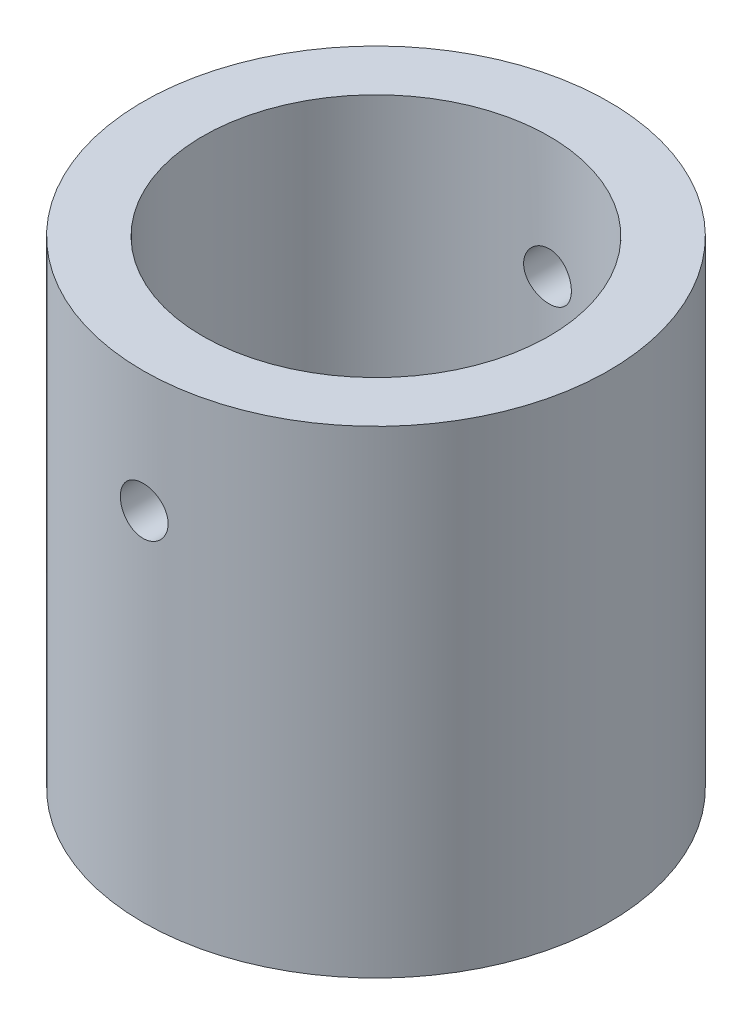
ISO-10303-21;
HEADER;
FILE_DESCRIPTION(('STEP AP214'),'2;1');
FILE_NAME('part.step','',(''),(''),'','','');
FILE_SCHEMA(('AUTOMOTIVE_DESIGN { 1 0 10303 214 1 1 1 1 }'));
ENDSEC;
DATA;
#1=APPLICATION_CONTEXT('core data for automotive mechanical design processes');
#2=APPLICATION_PROTOCOL_DEFINITION('international standard','automotive_design',2000,#1);
#3=PRODUCT_CONTEXT('',#1,'mechanical');
#4=PRODUCT('Part','Part','',(#3));
#5=PRODUCT_RELATED_PRODUCT_CATEGORY('part','',(#4));
#6=PRODUCT_DEFINITION_FORMATION('','',#4);
#7=PRODUCT_DEFINITION_CONTEXT('part definition',#1,'design');
#8=PRODUCT_DEFINITION('design','',#6,#7);
#9=PRODUCT_DEFINITION_SHAPE('','',#8);
#10=(LENGTH_UNIT() NAMED_UNIT(*) SI_UNIT(.MILLI.,.METRE.));
#11=(NAMED_UNIT(*) PLANE_ANGLE_UNIT() SI_UNIT($,.RADIAN.));
#12=(NAMED_UNIT(*) SI_UNIT($,.STERADIAN.) SOLID_ANGLE_UNIT());
#13=UNCERTAINTY_MEASURE_WITH_UNIT(LENGTH_MEASURE(1.E-05),#10,'distance_accuracy_value','');
#14=(GEOMETRIC_REPRESENTATION_CONTEXT(3) GLOBAL_UNCERTAINTY_ASSIGNED_CONTEXT((#13)) GLOBAL_UNIT_ASSIGNED_CONTEXT((#10,
#11,#12)) REPRESENTATION_CONTEXT('',''));
#15=CARTESIAN_POINT('',(0.,0.,0.));
#16=DIRECTION('',(0.,0.,1.));
#17=DIRECTION('',(1.,0.,0.));
#18=AXIS2_PLACEMENT_3D('',#15,#16,#17);
#19=CARTESIAN_POINT('',(0.,40.,0.));
#20=DIRECTION('',(0.,1.,0.));
#21=DIRECTION('',(0.,0.,1.));
#22=AXIS2_PLACEMENT_3D('',#19,#20,#21);
#23=PLANE('',#22);
#24=CARTESIAN_POINT('',(0.,40.,0.));
#25=DIRECTION('',(0.,1.,0.));
#26=DIRECTION('',(0.,0.,1.));
#27=AXIS2_PLACEMENT_3D('',#24,#25,#26);
#28=CIRCLE('',#27,19.5);
#29=CARTESIAN_POINT('',(0.,40.,19.5));
#30=VERTEX_POINT('',#29);
#31=EDGE_CURVE('E10',#30,#30,#28,.T.);
#32=ORIENTED_EDGE('',*,*,#31,.T.);
#33=EDGE_LOOP('',(#32));
#34=FACE_BOUND('',#33,.T.);
#35=CARTESIAN_POINT('',(0.,40.,0.));
#36=DIRECTION('',(0.,1.,0.));
#37=DIRECTION('',(0.,0.,1.));
#38=AXIS2_PLACEMENT_3D('',#35,#36,#37);
#39=CIRCLE('',#38,14.5);
#40=CARTESIAN_POINT('',(0.,40.,14.5));
#41=VERTEX_POINT('',#40);
#42=EDGE_CURVE('E49',#41,#41,#39,.T.);
#43=ORIENTED_EDGE('',*,*,#42,.F.);
#44=EDGE_LOOP('',(#43));
#45=FACE_BOUND('',#44,.T.);
#46=ADVANCED_FACE('F31',(#34,#45),#23,.T.);
#47=CARTESIAN_POINT('',(0.,0.,0.));
#48=DIRECTION('',(0.,1.,0.));
#49=DIRECTION('',(0.,0.,1.));
#50=AXIS2_PLACEMENT_3D('',#47,#48,#49);
#51=PLANE('',#50);
#52=CARTESIAN_POINT('',(0.,0.,0.));
#53=DIRECTION('',(0.,1.,0.));
#54=DIRECTION('',(0.,0.,1.));
#55=AXIS2_PLACEMENT_3D('',#52,#53,#54);
#56=CIRCLE('',#55,19.5);
#57=CARTESIAN_POINT('',(0.,0.,19.5));
#58=VERTEX_POINT('',#57);
#59=EDGE_CURVE('E44',#58,#58,#56,.T.);
#60=ORIENTED_EDGE('',*,*,#59,.F.);
#61=EDGE_LOOP('',(#60));
#62=FACE_BOUND('',#61,.T.);
#63=CARTESIAN_POINT('',(0.,0.,0.));
#64=DIRECTION('',(0.,1.,0.));
#65=DIRECTION('',(0.,0.,1.));
#66=AXIS2_PLACEMENT_3D('',#63,#64,#65);
#67=CIRCLE('',#66,14.5);
#68=CARTESIAN_POINT('',(0.,0.,14.5));
#69=VERTEX_POINT('',#68);
#70=EDGE_CURVE('E52',#69,#69,#67,.T.);
#71=ORIENTED_EDGE('',*,*,#70,.T.);
#72=EDGE_LOOP('',(#71));
#73=FACE_BOUND('',#72,.T.);
#74=ADVANCED_FACE('F85',(#62,#73),#51,.F.);
#75=CARTESIAN_POINT('',(0.,40.,0.));
#76=DIRECTION('',(0.,-1.,0.));
#77=DIRECTION('',(0.,0.,-1.));
#78=AXIS2_PLACEMENT_3D('',#75,#76,#77);
#79=CYLINDRICAL_SURFACE('',#78,19.5);
#80=CARTESIAN_POINT('',(0.,31.84,-19.5));
#81=CARTESIAN_POINT('',(-0.112025180184587,31.8399951565444,-19.4999986810511));
#82=CARTESIAN_POINT('',(-0.224124051119736,31.8305560757284,-19.4990243909818));
#83=CARTESIAN_POINT('',(-0.44521291074643,31.7930448263763,-19.4952314437903));
#84=CARTESIAN_POINT('',(-0.554199354046032,31.7649522284396,-19.4924107645438));
#85=CARTESIAN_POINT('',(-0.765829840515245,31.6909612949408,-19.4852433840448));
#86=CARTESIAN_POINT('',(-0.868477710756236,31.6450738277728,-19.4808976144101));
#87=CARTESIAN_POINT('',(-1.06459238823249,31.5368170888447,-19.4711657454073));
#88=CARTESIAN_POINT('',(-1.1580609928738,31.4744510526403,-19.4657798503229));
#89=CARTESIAN_POINT('',(-1.33353892458411,31.3347549149492,-19.454548129124));
#90=CARTESIAN_POINT('',(-1.41550871421624,31.2573752635115,-19.4487008191805));
#91=CARTESIAN_POINT('',(-1.56532230576065,31.0899541931553,-19.4372175375322));
#92=CARTESIAN_POINT('',(-1.63316544845783,30.9999121836806,-19.4315815756999));
#93=CARTESIAN_POINT('',(-1.75294069591951,30.8094739342035,-19.4211440076958));
#94=CARTESIAN_POINT('',(-1.80483689511347,30.7090549988947,-19.4163442947539));
#95=CARTESIAN_POINT('',(-1.89101584315679,30.5008706650061,-19.4081411822273));
#96=CARTESIAN_POINT('',(-1.92529904843721,30.3931054568829,-19.4047377464592));
#97=CARTESIAN_POINT('',(-1.97516132119122,30.1736916247417,-19.3997260285492));
#98=CARTESIAN_POINT('',(-1.99080608958079,30.0620580778236,-19.3981114420907));
#99=CARTESIAN_POINT('',(-2.00315050418271,29.8377389357326,-19.3968406876895));
#100=CARTESIAN_POINT('',(-1.99985067262354,29.7250533696452,-19.3971844657623));
#101=CARTESIAN_POINT('',(-1.97445368912684,29.5022822746382,-19.3997858396071));
#102=CARTESIAN_POINT('',(-1.95242833200684,29.392188463391,-19.4020361255961));
#103=CARTESIAN_POINT('',(-1.89031725581556,29.1772682698757,-19.4081855481584));
#104=CARTESIAN_POINT('',(-1.85023128137963,29.0724419621095,-19.4120847080455));
#105=CARTESIAN_POINT('',(-1.75305780976249,28.8708059626273,-19.421100941461));
#106=CARTESIAN_POINT('',(-1.69593852031016,28.774011698217,-19.4262202888213));
#107=CARTESIAN_POINT('',(-1.56634266101633,28.5913562588842,-19.4370981683549));
#108=CARTESIAN_POINT('',(-1.4938656182275,28.5054954207907,-19.4428567202101));
#109=CARTESIAN_POINT('',(-1.33521090456262,28.3467269547503,-19.4543967306967));
#110=CARTESIAN_POINT('',(-1.24897124093783,28.2738812595,-19.4601781716778));
#111=CARTESIAN_POINT('',(-1.06545440822544,28.1436911298861,-19.4710873345973));
#112=CARTESIAN_POINT('',(-0.968177225766599,28.0863467143017,-19.4762150557437));
#113=CARTESIAN_POINT('',(-0.765303339599141,27.9887891925955,-19.4852408349864));
#114=CARTESIAN_POINT('',(-0.65970508126519,27.9485792967481,-19.4891386626178));
#115=CARTESIAN_POINT('',(-0.443207123395545,27.8864779639034,-19.4952631497866));
#116=CARTESIAN_POINT('',(-0.332307590772803,27.8645859505605,-19.497489861903));
#117=CARTESIAN_POINT('',(-0.108891376667279,27.8398205431224,-19.5000144652782));
#118=CARTESIAN_POINT('',(0.003615739053416,27.8368617001957,-19.500321022412));
#119=CARTESIAN_POINT('',(0.227524253908415,27.849822095988,-19.4989940267487));
#120=CARTESIAN_POINT('',(0.33892566874793,27.8657410661811,-19.4973605015482));
#121=CARTESIAN_POINT('',(0.557213365608078,27.915934308039,-19.4923424321098));
#122=CARTESIAN_POINT('',(0.664108958318472,27.9501685026422,-19.4889617116019));
#123=CARTESIAN_POINT('',(0.870640224265548,28.0359791794391,-19.4808284462844));
#124=CARTESIAN_POINT('',(0.970275726685756,28.0875560695142,-19.4760758692107));
#125=CARTESIAN_POINT('',(1.15984443262927,28.2067994922284,-19.4657087369188));
#126=CARTESIAN_POINT('',(1.24974220690165,28.2745220857959,-19.4600912030288));
#127=CARTESIAN_POINT('',(1.41692478748063,28.4240542373167,-19.4486338743726));
#128=CARTESIAN_POINT('',(1.49420926035752,28.505864167548,-19.4427940737359));
#129=CARTESIAN_POINT('',(1.63426870733692,28.6816218842848,-19.4315242583797));
#130=CARTESIAN_POINT('',(1.69698754826951,28.7756145225913,-19.4260958815963));
#131=CARTESIAN_POINT('',(1.80574931296192,28.9728486589695,-19.416288629334));
#132=CARTESIAN_POINT('',(1.8517924749619,29.0760900248812,-19.4119097388618));
#133=CARTESIAN_POINT('',(1.92580219757973,29.2886995225691,-19.4047075591265));
#134=CARTESIAN_POINT('',(1.95380199488496,29.3980559837289,-19.4018814110666));
#135=CARTESIAN_POINT('',(1.99103794735862,29.6199486763091,-19.3980958808558));
#136=CARTESIAN_POINT('',(2.00027467117286,29.7324848112593,-19.3971364421313));
#137=CARTESIAN_POINT('',(1.99971415407476,29.9569843971802,-19.3971941927134));
#138=CARTESIAN_POINT('',(1.99000509057273,30.0689480810849,-19.3982022250288));
#139=CARTESIAN_POINT('',(1.95201365673844,30.2896447245419,-19.4020617974663));
#140=CARTESIAN_POINT('',(1.92373126697921,30.3983776807149,-19.4049133395166));
#141=CARTESIAN_POINT('',(1.84942065391082,30.6095246432533,-19.4121360664466));
#142=CARTESIAN_POINT('',(1.80339517615205,30.711939624414,-19.4165070162041));
#143=CARTESIAN_POINT('',(1.69491391423251,30.9076050407409,-19.4262765288457));
#144=CARTESIAN_POINT('',(1.63245819416312,31.0008555116541,-19.4316750877213));
#145=CARTESIAN_POINT('',(1.49255847083774,31.1759967259707,-19.4429216409658));
#146=CARTESIAN_POINT('',(1.41504873946363,31.2578348464039,-19.4487715358431));
#147=CARTESIAN_POINT('',(1.24737229417964,31.4073810988009,-19.4602443118059));
#148=CARTESIAN_POINT('',(1.1572025577871,31.4750858468992,-19.4658671382665));
#149=CARTESIAN_POINT('',(0.966504469217087,31.5945850184977,-19.4762677350467));
#150=CARTESIAN_POINT('',(0.865949470660139,31.6463370852421,-19.4810432415944));
#151=CARTESIAN_POINT('',(0.657591178452996,31.7321523276174,-19.4891867294249));
#152=CARTESIAN_POINT('',(0.549796184820649,31.7662353810575,-19.492556291572));
#153=CARTESIAN_POINT('',(0.36782966191562,31.8072776514574,-19.4966647237811));
#154=CARTESIAN_POINT('',(0.294820014441918,31.8195316868623,-19.4979095961627));
#155=CARTESIAN_POINT('',(0.147884281437661,31.8358944420465,-19.4995776678473));
#156=CARTESIAN_POINT('',(0.0739581999350986,31.8400031976138,-19.5000008707604));
#157=CARTESIAN_POINT('',(0.,31.84,-19.5));
#158=B_SPLINE_CURVE_WITH_KNOTS('',3,(#80,#81,#82,#83,#84,#85,#86,#87,#88,#89,#90,#91,#92,#93,
#94,#95,#96,#97,#98,#99,#100,#101,#102,#103,#104,#105,#106,#107,#108,#109,#110,#111,#112,#113,
#114,#115,#116,#117,#118,#119,#120,#121,#122,#123,#124,#125,#126,#127,#128,#129,#130,#131,#132,
#133,#134,#135,#136,#137,#138,#139,#140,#141,#142,#143,#144,#145,#146,#147,#148,#149,#150,#151,
#152,#153,#154,#155,#156,#157),.UNSPECIFIED.,.T.,.F.,(4,2,2,2,2,2,2,2,2,2,2,2,2,2,2,2,2,2,2,2,2,
2,2,2,2,2,2,2,2,2,2,2,2,2,2,2,2,2,4),(0.,0.335805465810196,0.671979314954098,1.00794816511979,
1.34385109698927,1.68088208026263,2.01792878744744,2.35572890853816,2.69352027528273,
3.03011736292738,3.3667051719521,3.70200827236165,4.03731611387398,4.37325375882587,
4.70920175059754,5.04670808298667,5.38421482424684,5.72178477202844,6.05934409826336,
6.39537887712019,6.73140887613862,7.06670656957086,7.40201214939106,7.73849937889948,
8.07499550192999,8.41276765964763,8.75053499153077,9.08767834875586,9.42481148814433,
9.76037928576568,10.095947434378,10.4314636782885,10.7669786134306,11.1039927984275,
11.4410875803209,11.7790698394226,12.1166710355561,12.3383683080806,12.5600646065267),.UNSPECIFIED.);
#159=CARTESIAN_POINT('',(0.,31.84,-19.5));
#160=VERTEX_POINT('',#159);
#161=EDGE_CURVE('E75',#160,#160,#158,.T.);
#162=ORIENTED_EDGE('',*,*,#161,.T.);
#163=EDGE_LOOP('',(#162));
#164=FACE_BOUND('',#163,.T.);
#165=CARTESIAN_POINT('',(2.,29.84,19.3971647412708));
#166=CARTESIAN_POINT('',(1.99999515498404,29.7279765671015,19.3971660862955));
#167=CARTESIAN_POINT('',(1.99055635866579,29.6158794379976,19.398145646451));
#168=CARTESIAN_POINT('',(1.95304634207056,29.394794197373,19.4019574182508));
#169=CARTESIAN_POINT('',(1.92495468633543,29.2858096326139,19.4047916617758));
#170=CARTESIAN_POINT('',(1.85096650902042,29.0741831185205,19.4119884614688));
#171=CARTESIAN_POINT('',(1.80508090061991,28.971537326209,19.416350080726));
#172=CARTESIAN_POINT('',(1.69682853909276,28.7754261310576,19.4261090366267));
#173=CARTESIAN_POINT('',(1.63446501696501,28.6819589333965,19.4315061701692));
#174=CARTESIAN_POINT('',(1.49477141995224,28.506479415505,19.442751112519));
#175=CARTESIAN_POINT('',(1.41739123333981,28.4245070777536,19.4486003897046));
#176=CARTESIAN_POINT('',(1.24996802239678,28.274688567564,19.4600772363726));
#177=CARTESIAN_POINT('',(1.15992441446707,28.2068430465237,19.4657047956218));
#178=CARTESIAN_POINT('',(0.969484761915491,28.0870653099918,19.4761186920135));
#179=CARTESIAN_POINT('',(0.869066296882535,28.0351685638262,19.4809031441958));
#180=CARTESIAN_POINT('',(0.660882985054666,27.9489884748535,19.4890757523583));
#181=CARTESIAN_POINT('',(0.553118326017952,27.9147046820757,19.4924639440092));
#182=CARTESIAN_POINT('',(0.333706185242859,27.8648411846937,19.4974519635801));
#183=CARTESIAN_POINT('',(0.222073791730641,27.8491957267737,19.4990580770264));
#184=CARTESIAN_POINT('',(-0.00224309125484129,27.8368495334774,19.50032235989));
#185=CARTESIAN_POINT('',(-0.114927552058712,27.8401482833568,19.4999805822347));
#186=CARTESIAN_POINT('',(-0.337703412749201,27.8655435525618,19.4973927312408));
#187=CARTESIAN_POINT('',(-0.44780296756946,27.887569365989,19.4951538208241));
#188=CARTESIAN_POINT('',(-0.662734412572125,27.9496833449842,19.4890315205295));
#189=CARTESIAN_POINT('',(-0.767566231272235,27.989771755585,19.4851481083426));
#190=CARTESIAN_POINT('',(-0.969208917931981,28.0869502750109,19.4761610606095));
#191=CARTESIAN_POINT('',(-1.06600463398567,28.1440716082942,19.4710551874865));
#192=CARTESIAN_POINT('',(-1.24866211015604,28.2736718316518,19.4601959851864));
#193=CARTESIAN_POINT('',(-1.33452353269818,28.3461511956907,19.4544426360301));
#194=CARTESIAN_POINT('',(-1.49328938324497,28.5048075579347,19.4429027024365));
#195=CARTESIAN_POINT('',(-1.56613234704964,28.591046074435,19.4371160869226));
#196=CARTESIAN_POINT('',(-1.69631751187591,28.7745596380684,19.4261882106982));
#197=CARTESIAN_POINT('',(-1.75365968845308,28.8718347026056,19.4210469510056));
#198=CARTESIAN_POINT('',(-1.85121559867517,29.0747080107386,19.41199148497));
#199=CARTESIAN_POINT('',(-1.89142543134983,29.1803081434417,19.4080775581397));
#200=CARTESIAN_POINT('',(-1.95352606366893,29.3968101761352,19.401925637188));
#201=CARTESIAN_POINT('',(-1.97541745105795,29.5077119059041,19.3996875892966));
#202=CARTESIAN_POINT('',(-2.00018049704348,29.7311291488575,19.3971501804423));
#203=CARTESIAN_POINT('',(-2.00313819112237,29.8436350305021,19.3968420499933));
#204=CARTESIAN_POINT('',(-1.99017593811496,30.06754080137,19.3981762163897));
#205=CARTESIAN_POINT('',(-1.9742562596023,30.1789407063055,19.3998184854862));
#206=CARTESIAN_POINT('',(-1.92406318723416,30.3972208579565,19.4048604273274));
#207=CARTESIAN_POINT('',(-1.889830564753,30.5041105778563,19.4082561955548));
#208=CARTESIAN_POINT('',(-1.80402499860733,30.7106307935379,19.4164193483894));
#209=CARTESIAN_POINT('',(-1.75245163778131,30.8102611146122,19.4211867659935));
#210=CARTESIAN_POINT('',(-1.63321341654562,30.9998262780295,19.431577255231));
#211=CARTESIAN_POINT('',(-1.5654915987522,31.0897251265064,19.4372033295689));
#212=CARTESIAN_POINT('',(-1.41596037051076,31.2569102357075,19.4486674227104));
#213=CARTESIAN_POINT('',(-1.33415059303401,31.3341961677295,19.4545054470327));
#214=CARTESIAN_POINT('',(-1.15839224184196,31.4742587852144,19.4657621550075));
#215=CARTESIAN_POINT('',(-1.06439878869371,31.5369793069032,19.471179163548));
#216=CARTESIAN_POINT('',(-0.867162572792643,31.6457440202851,19.4809590410667));
#217=CARTESIAN_POINT('',(-0.763919942502617,31.6917884507585,19.4853219251383));
#218=CARTESIAN_POINT('',(-0.551311228808036,31.7657990084471,19.4924944200789));
#219=CARTESIAN_POINT('',(-0.441957008530645,31.7937989220054,19.4953069324086));
#220=CARTESIAN_POINT('',(-0.220069043435315,31.8310358662422,19.4990737077235));
#221=CARTESIAN_POINT('',(-0.107535393047463,31.840273453575,19.5000280258391));
#222=CARTESIAN_POINT('',(0.116965661296226,31.8397154628768,19.4999708372938));
#223=CARTESIAN_POINT('',(0.228933294293402,31.8300070183282,19.4989683301382));
#224=CARTESIAN_POINT('',(0.449637990915387,31.792015433522,19.4951279026433));
#225=CARTESIAN_POINT('',(0.558375052372689,31.7637322808022,19.4922899810726));
#226=CARTESIAN_POINT('',(0.769530270258469,31.6894185847531,19.485096635418));
#227=CARTESIAN_POINT('',(0.871949386761828,31.6433907456509,19.4807414425706));
#228=CARTESIAN_POINT('',(1.0676220889245,31.5349034802115,19.4709987303201));
#229=CARTESIAN_POINT('',(1.16087571289594,31.4724441225627,19.4656112152324));
#230=CARTESIAN_POINT('',(1.33601676553482,31.3325403890817,19.4543775851625));
#231=CARTESIAN_POINT('',(1.41785223344902,31.255031117715,19.4485295517821));
#232=CARTESIAN_POINT('',(1.56739334893432,31.0873566851336,19.4370501510022));
#233=CARTESIAN_POINT('',(1.63509560567684,30.9971884954601,19.4314188358613));
#234=CARTESIAN_POINT('',(1.75459208521652,30.8064916764569,19.4209944411369));
#235=CARTESIAN_POINT('',(1.80634350657357,30.7059361220784,19.4162036314803));
#236=CARTESIAN_POINT('',(1.89215738854691,30.4975766528518,19.4080296667281));
#237=CARTESIAN_POINT('',(1.92623973561543,30.3897810417389,19.4046449299613));
#238=CARTESIAN_POINT('',(1.96728002307457,30.2078164072738,19.4005170175013));
#239=CARTESIAN_POINT('',(1.97953316592164,30.134809405821,19.3992658876056));
#240=CARTESIAN_POINT('',(1.99589473544343,29.9878789733452,19.3975893073598));
#241=CARTESIAN_POINT('',(2.00000319857903,29.9139555464262,19.3971638533134));
#242=CARTESIAN_POINT('',(2.,29.84,19.3971647412708));
#243=B_SPLINE_CURVE_WITH_KNOTS('',3,(#165,#166,#167,#168,#169,#170,#171,#172,#173,#174,#175,
#176,#177,#178,#179,#180,#181,#182,#183,#184,#185,#186,#187,#188,#189,#190,#191,#192,#193,#194,
#195,#196,#197,#198,#199,#200,#201,#202,#203,#204,#205,#206,#207,#208,#209,#210,#211,#212,#213,
#214,#215,#216,#217,#218,#219,#220,#221,#222,#223,#224,#225,#226,#227,#228,#229,#230,#231,#232,
#233,#234,#235,#236,#237,#238,#239,#240,#241,#242),.UNSPECIFIED.,.T.,.F.,(4,2,2,2,2,2,2,2,2,2,2,
2,2,2,2,2,2,2,2,2,2,2,2,2,2,2,2,2,2,2,2,2,2,2,2,2,2,2,4),(0.,0.335800217299413,
0.671968934596156,1.00793180206608,1.3438288425655,1.68086669430358,2.01792008366592,
2.35571772812507,2.69350674219483,3.030100523385,3.36668515883302,3.70200459997124,
4.0373285901099,4.37327110950005,4.70922399793363,5.0467233741842,5.38422328266131,
5.72179999758338,6.05936588099168,6.39539675575071,6.73142284976209,7.0667039202888,
7.40199305716014,7.73848275946201,8.07498122953968,8.41275644626175,8.75052682628377,
9.08766291724025,9.42478900565157,9.7603682925177,10.0959478045312,10.4314761956218,
10.76700318413,11.1040104584841,11.4410984946608,11.7790833307985,12.1166869363478,
12.3383762659198,12.5600646030635),.UNSPECIFIED.);
#244=CARTESIAN_POINT('',(2.,29.84,19.3971647412708));
#245=VERTEX_POINT('',#244);
#246=EDGE_CURVE('E71',#245,#245,#243,.T.);
#247=ORIENTED_EDGE('',*,*,#246,.T.);
#248=EDGE_LOOP('',(#247));
#249=FACE_BOUND('',#248,.T.);
#250=ORIENTED_EDGE('',*,*,#31,.F.);
#251=EDGE_LOOP('',(#250));
#252=FACE_BOUND('',#251,.T.);
#253=ORIENTED_EDGE('',*,*,#59,.T.);
#254=EDGE_LOOP('',(#253));
#255=FACE_BOUND('',#254,.T.);
#256=ADVANCED_FACE('F33',(#164,#249,#252,#255),#79,.T.);
#257=CARTESIAN_POINT('',(0.,40.,0.));
#258=DIRECTION('',(0.,-1.,0.));
#259=DIRECTION('',(0.,0.,-1.));
#260=AXIS2_PLACEMENT_3D('',#257,#258,#259);
#261=CYLINDRICAL_SURFACE('',#260,14.5);
#262=CARTESIAN_POINT('',(0.,31.84,-14.5));
#263=CARTESIAN_POINT('',(-0.111771782255015,31.8399953165526,-14.4999983145304));
#264=CARTESIAN_POINT('',(-0.223610945467071,31.8305986887042,-14.4986940304641));
#265=CARTESIAN_POINT('',(-0.444170253150492,31.7932659525588,-14.4936164731435));
#266=CARTESIAN_POINT('',(-0.552887133913179,31.7653111322244,-14.4898407079737));
#267=CARTESIAN_POINT('',(-0.763977449731497,31.691707226282,-14.4802450300764));
#268=CARTESIAN_POINT('',(-0.866355355121735,31.6460707787088,-14.4744265776484));
#269=CARTESIAN_POINT('',(-1.06198220004484,31.5384283684944,-14.4613905746173));
#270=CARTESIAN_POINT('',(-1.15523255415148,31.4764249479051,-14.4541732413289));
#271=CARTESIAN_POINT('',(-1.33059490257932,31.3373686454098,-14.439090026744));
#272=CARTESIAN_POINT('',(-1.4126374216345,31.2602285302921,-14.4312205466596));
#273=CARTESIAN_POINT('',(-1.56265631524633,31.0932761320123,-14.4157485695573));
#274=CARTESIAN_POINT('',(-1.63063192877154,31.0034631636799,-14.4081460870026));
#275=CARTESIAN_POINT('',(-1.75085222768552,30.8132551390636,-14.3940337797335));
#276=CARTESIAN_POINT('',(-1.80303073157085,30.7128178784863,-14.387528601152));
#277=CARTESIAN_POINT('',(-1.88975287311594,30.5045009723364,-14.3763958401487));
#278=CARTESIAN_POINT('',(-1.92429732308241,30.3966216698387,-14.371768171242));
#279=CARTESIAN_POINT('',(-1.97455724619643,30.177209165711,-14.364949334221));
#280=CARTESIAN_POINT('',(-1.99039089662152,30.0657035179956,-14.3627428801251));
#281=CARTESIAN_POINT('',(-2.00314565332517,29.8415976574384,-14.3609697255537));
#282=CARTESIAN_POINT('',(-2.00006768056576,29.7289974981639,-14.3614028965333));
#283=CARTESIAN_POINT('',(-1.97518335555223,29.5067280409244,-14.3648460628672));
#284=CARTESIAN_POINT('',(-1.95350789010314,29.3970437705488,-14.3678380491279));
#285=CARTESIAN_POINT('',(-1.89224841606513,29.18288421653,-14.3760336186403));
#286=CARTESIAN_POINT('',(-1.85266397299994,29.0784090593295,-14.381237255547));
#287=CARTESIAN_POINT('',(-1.75657177984699,28.8772309368618,-14.3932899730117));
#288=CARTESIAN_POINT('',(-1.7000078655931,28.7805551378477,-14.4001444992213));
#289=CARTESIAN_POINT('',(-1.57160245870337,28.5980179382376,-14.4147225990986));
#290=CARTESIAN_POINT('',(-1.4997601164572,28.5121571394704,-14.4224462210843));
#291=CARTESIAN_POINT('',(-1.34211523789642,28.3529280586261,-14.4379720826066));
#292=CARTESIAN_POINT('',(-1.25620002309771,28.2796712989793,-14.4457744356076));
#293=CARTESIAN_POINT('',(-1.07323422973863,28.1486005356117,-14.4605178909198));
#294=CARTESIAN_POINT('',(-0.976183615049901,28.0907865819966,-14.4674589904367));
#295=CARTESIAN_POINT('',(-0.773610653626886,27.9922396873459,-14.4797035649538));
#296=CARTESIAN_POINT('',(-0.668084471836535,27.9515145311821,-14.485006293298));
#297=CARTESIAN_POINT('',(-0.451601724985182,27.8883939567783,-14.4933701764699));
#298=CARTESIAN_POINT('',(-0.340645470275087,27.865997492272,-14.4964314592463));
#299=CARTESIAN_POINT('',(-0.117415617081672,27.8403164521057,-14.499950744306));
#300=CARTESIAN_POINT('',(-0.00515999171124926,27.8368784024449,-14.5004296509885));
#301=CARTESIAN_POINT('',(0.218325981439941,27.848805603439,-14.4987868946504));
#302=CARTESIAN_POINT('',(0.329556355857927,27.8641703641796,-14.4966652993867));
#303=CARTESIAN_POINT('',(0.547375596838829,27.9131394680984,-14.4900728834365));
#304=CARTESIAN_POINT('',(0.653981405715148,27.9466698427565,-14.4856115920925));
#305=CARTESIAN_POINT('',(0.860057551874813,28.030940923923,-14.4748387848992));
#306=CARTESIAN_POINT('',(0.959527599721318,28.0816823280582,-14.4685271940518));
#307=CARTESIAN_POINT('',(1.14918885020547,28.1993008415884,-14.4547042200532));
#308=CARTESIAN_POINT('',(1.23931854001307,28.2662762783571,-14.4471856237026));
#309=CARTESIAN_POINT('',(1.40711288875202,28.414323666139,-14.4318102158341));
#310=CARTESIAN_POINT('',(1.4847769398995,28.4953963040844,-14.423953387849));
#311=CARTESIAN_POINT('',(1.62598685738371,28.670016415235,-14.4087216361406));
#312=CARTESIAN_POINT('',(1.68943041154324,28.7636470005304,-14.4013504582519));
#313=CARTESIAN_POINT('',(1.79968944890341,28.960325750303,-14.3879885861327));
#314=CARTESIAN_POINT('',(1.84650532473323,29.063373692336,-14.3819978593068));
#315=CARTESIAN_POINT('',(1.92201791311758,29.2756443047164,-14.3721015450655));
#316=CARTESIAN_POINT('',(1.95077040216643,29.384846821335,-14.3681895447425));
#317=CARTESIAN_POINT('',(1.98951867875624,29.6065880336383,-14.3628759068918));
#318=CARTESIAN_POINT('',(1.99951554598356,29.7191265369047,-14.3614741248611));
#319=CARTESIAN_POINT('',(2.0004460782285,29.9433264275999,-14.3613444524612));
#320=CARTESIAN_POINT('',(1.99154053307902,30.0549871683144,-14.3625940089465));
#321=CARTESIAN_POINT('',(1.9552615439198,30.27520769863,-14.3675774730918));
#322=CARTESIAN_POINT('',(1.9278881124051,30.3837674903291,-14.3713113790711));
#323=CARTESIAN_POINT('',(1.85550397444985,30.5946716956169,-14.3808353986625));
#324=CARTESIAN_POINT('',(1.81050275819885,30.6970194193831,-14.3866244057225));
#325=CARTESIAN_POINT('',(1.7041562957287,30.89273756377,-14.399607924192));
#326=CARTESIAN_POINT('',(1.64281067041651,30.9861077760974,-14.4068024682007));
#327=CARTESIAN_POINT('',(1.5049261358674,31.1620400761857,-14.421859538483));
#328=CARTESIAN_POINT('',(1.42826770925532,31.2445080783589,-14.4297270218845));
#329=CARTESIAN_POINT('',(1.2621853422954,31.3954686744931,-14.4452008978638));
#330=CARTESIAN_POINT('',(1.17275841952479,31.4639579942544,-14.4528072289262));
#331=CARTESIAN_POINT('',(0.98319593989737,31.5852943123367,-14.4669414028435));
#332=CARTESIAN_POINT('',(0.883012756117929,31.6380674794872,-14.4734640935461));
#333=CARTESIAN_POINT('',(0.675166996113407,31.7259623660074,-14.4846448909311));
#334=CARTESIAN_POINT('',(0.56751249842144,31.76110282283,-14.4893049758408));
#335=CARTESIAN_POINT('',(0.382780409393608,31.8045394852992,-14.4951414673414));
#336=CARTESIAN_POINT('',(0.306856193752554,31.817817474804,-14.4969543048092));
#337=CARTESIAN_POINT('',(0.153965304348375,31.8355493024884,-14.4993841458831));
#338=CARTESIAN_POINT('',(0.0769986407192194,31.8400032263875,-14.5000011611059));
#339=CARTESIAN_POINT('',(0.,31.84,-14.5));
#340=B_SPLINE_CURVE_WITH_KNOTS('',3,(#262,#263,#264,#265,#266,#267,#268,#269,#270,#271,#272,
#273,#274,#275,#276,#277,#278,#279,#280,#281,#282,#283,#284,#285,#286,#287,#288,#289,#290,#291,
#292,#293,#294,#295,#296,#297,#298,#299,#300,#301,#302,#303,#304,#305,#306,#307,#308,#309,#310,
#311,#312,#313,#314,#315,#316,#317,#318,#319,#320,#321,#322,#323,#324,#325,#326,#327,#328,#329,
#330,#331,#332,#333,#334,#335,#336,#337,#338,#339),.UNSPECIFIED.,.T.,.F.,(4,2,2,2,2,2,2,2,2,2,2,
2,2,2,2,2,2,2,2,2,2,2,2,2,2,2,2,2,2,2,2,2,2,2,2,2,2,2,4),(0.,0.335034041900404,
0.670406409349956,1.00553950856274,1.34062058685763,1.67769268156906,2.01478300740017,
2.35326661939163,2.69173463784307,3.02805327039063,3.36435552495574,3.69831016124935,
4.03227289979991,4.36735271595419,4.7024511702661,5.04037712041041,5.3783041669734,
5.71638499089567,6.05444651462918,6.38976726737104,6.72507928339099,7.05903609419514,
7.39300644312301,7.72905250208165,8.06511494057563,8.40352272845119,8.74192252497614,
9.07927220045393,9.41660245546051,9.75107477879539,10.0855468758325,10.4198391515971,
10.7541391816283,11.0911582656328,11.4282561986021,11.766913632115,12.105210424081,
12.3360147997982,12.5668169334006),.UNSPECIFIED.);
#341=CARTESIAN_POINT('',(0.,31.84,-14.5));
#342=VERTEX_POINT('',#341);
#343=EDGE_CURVE('E36',#342,#342,#340,.T.);
#344=ORIENTED_EDGE('',*,*,#343,.F.);
#345=EDGE_LOOP('',(#344));
#346=FACE_BOUND('',#345,.T.);
#347=CARTESIAN_POINT('',(2.,29.84,14.3614066163451));
#348=CARTESIAN_POINT('',(1.99999531160166,29.7282339192475,14.3614083625701));
#349=CARTESIAN_POINT('',(1.99059961001874,29.616400441491,14.3627254295864));
#350=CARTESIAN_POINT('',(1.95327088709236,29.3958529449147,14.3678486244426));
#351=CARTESIAN_POINT('',(1.92531913338241,29.287142194309,14.371657267476));
#352=CARTESIAN_POINT('',(1.8517241965142,29.0760648468641,14.3813242074303));
#353=CARTESIAN_POINT('',(1.80609379661412,28.973693727794,14.3871810230401));
#354=CARTESIAN_POINT('',(1.69846563271024,28.7780782758978,14.4002826236974));
#355=CARTESIAN_POINT('',(1.63647039615497,28.6848325367585,14.4075271943674));
#356=CARTESIAN_POINT('',(1.4974223989857,28.5094650682146,14.4226430437203));
#357=CARTESIAN_POINT('',(1.42028057335359,28.4274142543897,14.4305178577144));
#358=CARTESIAN_POINT('',(1.25332125913333,28.2773793256453,14.4459752335317));
#359=CARTESIAN_POINT('',(1.16350310813857,28.2093959462836,14.4535577800559));
#360=CARTESIAN_POINT('',(0.973290452287549,28.0891674541495,14.4676128967092));
#361=CARTESIAN_POINT('',(0.872854634802144,28.0369871164741,14.4740808528128));
#362=CARTESIAN_POINT('',(0.664540862123763,27.9502611878165,14.4851390104675));
#363=CARTESIAN_POINT('',(0.556663241101612,27.9157148055738,14.4897292962705));
#364=CARTESIAN_POINT('',(0.337256253733146,27.8654509515881,14.4964899898084));
#365=CARTESIAN_POINT('',(0.225754483713475,27.8496150974716,14.4986756058742));
#366=CARTESIAN_POINT('',(0.00165624290617021,27.8368545894437,14.5004327314837));
#367=CARTESIAN_POINT('',(-0.110940175745801,27.8399290392398,14.5000043649225));
#368=CARTESIAN_POINT('',(-0.333224973143076,27.864807713458,14.496594018656));
#369=CARTESIAN_POINT('',(-0.442927907846334,27.8864846002245,14.4936294005615));
#370=CARTESIAN_POINT('',(-0.657124053813942,27.9477533580355,14.4854990487806));
#371=CARTESIAN_POINT('',(-0.761617148207217,27.987345630771,14.4803332657409));
#372=CARTESIAN_POINT('',(-0.962817297353835,28.083454184091,14.4683510916218));
#373=CARTESIAN_POINT('',(-1.05949805689999,28.1400248267298,14.4615294122443));
#374=CARTESIAN_POINT('',(-1.24204233885162,28.2684446741172,14.4469972159453));
#375=CARTESIAN_POINT('',(-1.32790525753614,28.340294730977,14.4392866494628));
#376=CARTESIAN_POINT('',(-1.48712589886147,28.4979451742219,14.4237623969894));
#377=CARTESIAN_POINT('',(-1.56037364831337,28.5838566411935,14.4159483867633));
#378=CARTESIAN_POINT('',(-1.69142800485719,28.7668116931912,14.401160871778));
#379=CARTESIAN_POINT('',(-1.74923454254509,28.8638553282505,14.3941873707967));
#380=CARTESIAN_POINT('',(-1.84777606376466,29.0664262083133,14.3818706412671));
#381=CARTESIAN_POINT('',(-1.88850100662797,29.1719583996345,14.3765283720676));
#382=CARTESIAN_POINT('',(-1.9516193216908,29.3884542369869,14.3680967931091));
#383=CARTESIAN_POINT('',(-1.97401377779272,29.4994175614578,14.3650073501391));
#384=CARTESIAN_POINT('',(-1.99968722359251,29.7226510022969,14.3614560645899));
#385=CARTESIAN_POINT('',(-2.00312153655887,29.8349029280791,14.3609728721167));
#386=CARTESIAN_POINT('',(-1.99118818249391,30.0583806116254,14.3626322271079));
#387=CARTESIAN_POINT('',(-1.97582100607775,30.1696063960898,14.3647747060568));
#388=CARTESIAN_POINT('',(-1.92685214913448,30.3874012725679,14.3714244566748));
#389=CARTESIAN_POINT('',(-1.89332675253117,30.4939878445944,14.3759218326507));
#390=CARTESIAN_POINT('',(-1.80907205016032,30.70002771211,14.3867665521429));
#391=CARTESIAN_POINT('',(-1.75834201707481,30.799480705815,14.3931139738674));
#392=CARTESIAN_POINT('',(-1.64074051048974,30.9891298505101,14.406994323589));
#393=CARTESIAN_POINT('',(-1.57376782819061,31.0792626966977,14.4145345775159));
#394=CARTESIAN_POINT('',(-1.42572402089194,31.247064691853,14.4299284726678));
#395=CARTESIAN_POINT('',(-1.34465222512572,31.3247332474926,14.4377821287892));
#396=CARTESIAN_POINT('',(-1.17003025307235,31.465953594722,14.4529840811805));
#397=CARTESIAN_POINT('',(-1.07639679388251,31.5294028881701,14.4603284601594));
#398=CARTESIAN_POINT('',(-0.879710699219791,31.6396719857006,14.4736246655395));
#399=CARTESIAN_POINT('',(-0.776658288132497,31.6864921858045,14.4795765251025));
#400=CARTESIAN_POINT('',(-0.564389934838083,31.7620074889183,14.4893998089259));
#401=CARTESIAN_POINT('',(-0.45519482006689,31.7907602404833,14.4932778442616));
#402=CARTESIAN_POINT('',(-0.233469274771306,31.8295115476872,14.4985441365321));
#403=CARTESIAN_POINT('',(-0.120939029469844,31.8395111428439,14.4999325314715));
#404=CARTESIAN_POINT('',(0.103265006985069,31.8404499176655,14.5000620972535));
#405=CARTESIAN_POINT('',(0.214938158626523,31.8315465327814,14.4988251336977));
#406=CARTESIAN_POINT('',(0.43518406592698,31.7952675106141,14.4938867279694));
#407=CARTESIAN_POINT('',(0.543756827298258,31.7678919073672,14.4901852903377));
#408=CARTESIAN_POINT('',(0.754688060921663,31.6954982224758,14.4807318657505));
#409=CARTESIAN_POINT('',(0.857049749665676,31.6504893640869,14.474980950937));
#410=CARTESIAN_POINT('',(1.05279265541694,31.5441232728623,14.4620628164094));
#411=CARTESIAN_POINT('',(1.14617367281622,31.4827656767673,14.454895565226));
#412=CARTESIAN_POINT('',(1.32210615684901,31.3448676354373,14.4398720472284));
#413=CARTESIAN_POINT('',(1.40456568512367,31.2682104319823,14.4320107584594));
#414=CARTESIAN_POINT('',(1.55550975346759,31.1021340437102,14.4165239254039));
#415=CARTESIAN_POINT('',(1.62399099670401,31.0127118566536,14.4088984370908));
#416=CARTESIAN_POINT('',(1.74531821928251,30.8231535665906,14.3947082051736));
#417=CARTESIAN_POINT('',(1.79808901895741,30.7229689736466,14.3881486281202));
#418=CARTESIAN_POINT('',(1.88597909381692,30.51512029958,14.3768933882765));
#419=CARTESIAN_POINT('',(1.9211171333275,30.4074643088441,14.3721957451883));
#420=CARTESIAN_POINT('',(1.96454727304452,30.2227386239448,14.3663096989907));
#421=CARTESIAN_POINT('',(1.97782232978071,30.1468227609561,14.364480489359));
#422=CARTESIAN_POINT('',(1.99555026367846,29.9939485853218,14.36202835266));
#423=CARTESIAN_POINT('',(2.00000322961236,29.9169902831735,14.3614054134546));
#424=CARTESIAN_POINT('',(2.,29.84,14.3614066163451));
#425=B_SPLINE_CURVE_WITH_KNOTS('',3,(#347,#348,#349,#350,#351,#352,#353,#354,#355,#356,#357,
#358,#359,#360,#361,#362,#363,#364,#365,#366,#367,#368,#369,#370,#371,#372,#373,#374,#375,#376,
#377,#378,#379,#380,#381,#382,#383,#384,#385,#386,#387,#388,#389,#390,#391,#392,#393,#394,#395,
#396,#397,#398,#399,#400,#401,#402,#403,#404,#405,#406,#407,#408,#409,#410,#411,#412,#413,#414,
#415,#416,#417,#418,#419,#420,#421,#422,#423,#424),.UNSPECIFIED.,.T.,.F.,(4,2,2,2,2,2,2,2,2,2,2,
2,2,2,2,2,2,2,2,2,2,2,2,2,2,2,2,2,2,2,2,2,2,2,2,2,2,2,4),(0.,0.335016912350331,
0.670372540182191,1.005486126825,1.34054798748364,1.67764250380775,2.01475464167119,
2.35323042840812,2.69169102592411,3.02799850071748,3.36429003565396,3.6982977794911,
4.03231301267429,4.36740933083253,4.70252434173616,5.04042718053408,5.37833153808709,
5.71643424052424,6.05451694912175,6.3898258963526,6.72512609405617,7.05902847661868,
7.39294497650838,7.72899814288521,8.0650673013993,8.40348618168419,8.74189700199226,
9.0792224836019,9.416529266164,9.75103777928711,10.0855456760593,10.4198788381359,
10.7542194295176,11.0912164406832,11.428292842297,11.7669572542983,12.1052605000562,
12.3360398771512,12.5668169320152),.UNSPECIFIED.);
#426=CARTESIAN_POINT('',(2.,29.84,14.3614066163451));
#427=VERTEX_POINT('',#426);
#428=EDGE_CURVE('E54',#427,#427,#425,.T.);
#429=ORIENTED_EDGE('',*,*,#428,.F.);
#430=EDGE_LOOP('',(#429));
#431=FACE_BOUND('',#430,.T.);
#432=ORIENTED_EDGE('',*,*,#42,.T.);
#433=EDGE_LOOP('',(#432));
#434=FACE_BOUND('',#433,.T.);
#435=ORIENTED_EDGE('',*,*,#70,.F.);
#436=EDGE_LOOP('',(#435));
#437=FACE_BOUND('',#436,.T.);
#438=ADVANCED_FACE('F58',(#346,#431,#434,#437),#261,.F.);
#439=CARTESIAN_POINT('',(0.,29.84,-22.5));
#440=DIRECTION('',(0.,0.,1.));
#441=DIRECTION('',(1.,0.,0.));
#442=AXIS2_PLACEMENT_3D('',#439,#440,#441);
#443=CYLINDRICAL_SURFACE('',#442,2.);
#444=ORIENTED_EDGE('',*,*,#428,.T.);
#445=EDGE_LOOP('',(#444));
#446=FACE_BOUND('',#445,.T.);
#447=ORIENTED_EDGE('',*,*,#246,.F.);
#448=EDGE_LOOP('',(#447));
#449=FACE_BOUND('',#448,.T.);
#450=ADVANCED_FACE('F64',(#446,#449),#443,.F.);
#451=ORIENTED_EDGE('',*,*,#343,.T.);
#452=EDGE_LOOP('',(#451));
#453=FACE_BOUND('',#452,.T.);
#454=ORIENTED_EDGE('',*,*,#161,.F.);
#455=EDGE_LOOP('',(#454));
#456=FACE_BOUND('',#455,.T.);
#457=ADVANCED_FACE('F61',(#453,#456),#443,.F.);
#458=CLOSED_SHELL('',(#46,#74,#256,#438,#450,#457));
#459=MANIFOLD_SOLID_BREP('B2',#458);
#460=ADVANCED_BREP_SHAPE_REPRESENTATION('',(#18,#459),#14);
#461=SHAPE_DEFINITION_REPRESENTATION(#9,#460);
ENDSEC;
END-ISO-10303-21;
